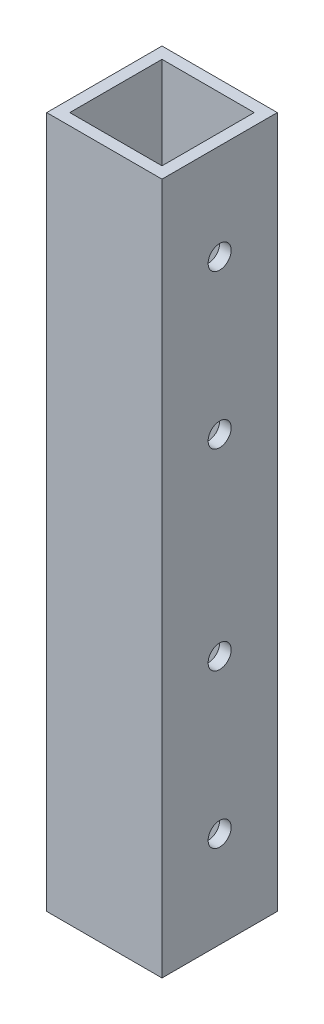
ISO-10303-21;
HEADER;
FILE_DESCRIPTION(('STEP AP214'),'2;1');
FILE_NAME('part.step','',(''),(''),'','','');
FILE_SCHEMA(('AUTOMOTIVE_DESIGN { 1 0 10303 214 1 1 1 1 }'));
ENDSEC;
DATA;
#1=APPLICATION_CONTEXT('core data for automotive mechanical design processes');
#2=APPLICATION_PROTOCOL_DEFINITION('international standard','automotive_design',2000,#1);
#3=PRODUCT_CONTEXT('',#1,'mechanical');
#4=PRODUCT('Part','Part','',(#3));
#5=PRODUCT_RELATED_PRODUCT_CATEGORY('part','',(#4));
#6=PRODUCT_DEFINITION_FORMATION('','',#4);
#7=PRODUCT_DEFINITION_CONTEXT('part definition',#1,'design');
#8=PRODUCT_DEFINITION('design','',#6,#7);
#9=PRODUCT_DEFINITION_SHAPE('','',#8);
#10=(LENGTH_UNIT() NAMED_UNIT(*) SI_UNIT(.MILLI.,.METRE.));
#11=(NAMED_UNIT(*) PLANE_ANGLE_UNIT() SI_UNIT($,.RADIAN.));
#12=(NAMED_UNIT(*) SI_UNIT($,.STERADIAN.) SOLID_ANGLE_UNIT());
#13=UNCERTAINTY_MEASURE_WITH_UNIT(LENGTH_MEASURE(1.E-05),#10,'distance_accuracy_value','');
#14=(GEOMETRIC_REPRESENTATION_CONTEXT(3) GLOBAL_UNCERTAINTY_ASSIGNED_CONTEXT((#13)) GLOBAL_UNIT_ASSIGNED_CONTEXT((#10,
#11,#12)) REPRESENTATION_CONTEXT('',''));
#15=CARTESIAN_POINT('',(0.,0.,0.));
#16=DIRECTION('',(0.,0.,1.));
#17=DIRECTION('',(1.,0.,0.));
#18=AXIS2_PLACEMENT_3D('',#15,#16,#17);
#19=CARTESIAN_POINT('',(0.,90.,0.));
#20=DIRECTION('',(0.,1.,0.));
#21=DIRECTION('',(0.,0.,1.));
#22=AXIS2_PLACEMENT_3D('',#19,#20,#21);
#23=PLANE('',#22);
#24=DIRECTION('',(0.,0.,1.));
#25=VECTOR('',#24,1.);
#26=CARTESIAN_POINT('',(0.,90.,0.));
#27=LINE('',#26,#25);
#28=CARTESIAN_POINT('',(0.,90.,-15.));
#29=VERTEX_POINT('',#28);
#30=CARTESIAN_POINT('',(0.,90.,0.));
#31=VERTEX_POINT('',#30);
#32=EDGE_CURVE('E171',#29,#31,#27,.T.);
#33=ORIENTED_EDGE('',*,*,#32,.T.);
#34=DIRECTION('',(1.,0.,0.));
#35=VECTOR('',#34,1.);
#36=CARTESIAN_POINT('',(0.,90.,0.));
#37=LINE('',#36,#35);
#38=CARTESIAN_POINT('',(15.,90.,0.));
#39=VERTEX_POINT('',#38);
#40=EDGE_CURVE('E174',#31,#39,#37,.T.);
#41=ORIENTED_EDGE('',*,*,#40,.T.);
#42=DIRECTION('',(0.,0.,-1.));
#43=VECTOR('',#42,1.);
#44=CARTESIAN_POINT('',(15.,90.,0.));
#45=LINE('',#44,#43);
#46=CARTESIAN_POINT('',(15.,90.,-15.));
#47=VERTEX_POINT('',#46);
#48=EDGE_CURVE('E177',#39,#47,#45,.T.);
#49=ORIENTED_EDGE('',*,*,#48,.T.);
#50=DIRECTION('',(-1.,0.,0.));
#51=VECTOR('',#50,1.);
#52=CARTESIAN_POINT('',(0.,90.,-15.));
#53=LINE('',#52,#51);
#54=EDGE_CURVE('E179',#47,#29,#53,.T.);
#55=ORIENTED_EDGE('',*,*,#54,.T.);
#56=EDGE_LOOP('',(#33,#41,#49,#55));
#57=FACE_BOUND('',#56,.T.);
#58=DIRECTION('',(1.,0.,0.));
#59=VECTOR('',#58,1.);
#60=CARTESIAN_POINT('',(0.,90.,-1.5));
#61=LINE('',#60,#59);
#62=CARTESIAN_POINT('',(1.5,90.,-1.5));
#63=VERTEX_POINT('',#62);
#64=CARTESIAN_POINT('',(13.5,90.,-1.5));
#65=VERTEX_POINT('',#64);
#66=EDGE_CURVE('E141',#63,#65,#61,.T.);
#67=ORIENTED_EDGE('',*,*,#66,.F.);
#68=DIRECTION('',(0.,0.,1.));
#69=VECTOR('',#68,1.);
#70=CARTESIAN_POINT('',(1.5,90.,0.));
#71=LINE('',#70,#69);
#72=CARTESIAN_POINT('',(1.5,90.,-13.5));
#73=VERTEX_POINT('',#72);
#74=EDGE_CURVE('E133',#73,#63,#71,.T.);
#75=ORIENTED_EDGE('',*,*,#74,.F.);
#76=DIRECTION('',(-1.,0.,0.));
#77=VECTOR('',#76,1.);
#78=CARTESIAN_POINT('',(0.,90.,-13.5));
#79=LINE('',#78,#77);
#80=CARTESIAN_POINT('',(13.5,90.,-13.5));
#81=VERTEX_POINT('',#80);
#82=EDGE_CURVE('E155',#81,#73,#79,.T.);
#83=ORIENTED_EDGE('',*,*,#82,.F.);
#84=DIRECTION('',(0.,0.,-1.));
#85=VECTOR('',#84,1.);
#86=CARTESIAN_POINT('',(13.5,90.,0.));
#87=LINE('',#86,#85);
#88=EDGE_CURVE('E153',#65,#81,#87,.T.);
#89=ORIENTED_EDGE('',*,*,#88,.F.);
#90=EDGE_LOOP('',(#67,#75,#83,#89));
#91=FACE_BOUND('',#90,.T.);
#92=ADVANCED_FACE('F66',(#57,#91),#23,.T.);
#93=CARTESIAN_POINT('',(0.,0.,0.));
#94=DIRECTION('',(0.,1.,0.));
#95=DIRECTION('',(0.,0.,1.));
#96=AXIS2_PLACEMENT_3D('',#93,#94,#95);
#97=PLANE('',#96);
#98=DIRECTION('',(0.,0.,1.));
#99=VECTOR('',#98,1.);
#100=CARTESIAN_POINT('',(0.,0.,0.));
#101=LINE('',#100,#99);
#102=CARTESIAN_POINT('',(0.,0.,-15.));
#103=VERTEX_POINT('',#102);
#104=CARTESIAN_POINT('',(0.,0.,0.));
#105=VERTEX_POINT('',#104);
#106=EDGE_CURVE('E149',#103,#105,#101,.T.);
#107=ORIENTED_EDGE('',*,*,#106,.F.);
#108=DIRECTION('',(-1.,0.,0.));
#109=VECTOR('',#108,1.);
#110=CARTESIAN_POINT('',(0.,0.,-15.));
#111=LINE('',#110,#109);
#112=CARTESIAN_POINT('',(15.,0.,-15.));
#113=VERTEX_POINT('',#112);
#114=EDGE_CURVE('E175',#113,#103,#111,.T.);
#115=ORIENTED_EDGE('',*,*,#114,.F.);
#116=DIRECTION('',(0.,0.,-1.));
#117=VECTOR('',#116,1.);
#118=CARTESIAN_POINT('',(15.,0.,0.));
#119=LINE('',#118,#117);
#120=CARTESIAN_POINT('',(15.,0.,0.));
#121=VERTEX_POINT('',#120);
#122=EDGE_CURVE('E186',#121,#113,#119,.T.);
#123=ORIENTED_EDGE('',*,*,#122,.F.);
#124=DIRECTION('',(1.,0.,0.));
#125=VECTOR('',#124,1.);
#126=CARTESIAN_POINT('',(0.,0.,0.));
#127=LINE('',#126,#125);
#128=EDGE_CURVE('E184',#105,#121,#127,.T.);
#129=ORIENTED_EDGE('',*,*,#128,.F.);
#130=EDGE_LOOP('',(#107,#115,#123,#129));
#131=FACE_BOUND('',#130,.T.);
#132=DIRECTION('',(0.,0.,1.));
#133=VECTOR('',#132,1.);
#134=CARTESIAN_POINT('',(1.5,0.,0.));
#135=LINE('',#134,#133);
#136=CARTESIAN_POINT('',(1.5,0.,-13.5));
#137=VERTEX_POINT('',#136);
#138=CARTESIAN_POINT('',(1.5,0.,-1.5));
#139=VERTEX_POINT('',#138);
#140=EDGE_CURVE('E91',#137,#139,#135,.T.);
#141=ORIENTED_EDGE('',*,*,#140,.T.);
#142=DIRECTION('',(1.,0.,0.));
#143=VECTOR('',#142,1.);
#144=CARTESIAN_POINT('',(0.,0.,-1.5));
#145=LINE('',#144,#143);
#146=CARTESIAN_POINT('',(13.5,0.,-1.5));
#147=VERTEX_POINT('',#146);
#148=EDGE_CURVE('E148',#139,#147,#145,.T.);
#149=ORIENTED_EDGE('',*,*,#148,.T.);
#150=DIRECTION('',(0.,0.,-1.));
#151=VECTOR('',#150,1.);
#152=CARTESIAN_POINT('',(13.5,0.,0.));
#153=LINE('',#152,#151);
#154=CARTESIAN_POINT('',(13.5,0.,-13.5));
#155=VERTEX_POINT('',#154);
#156=EDGE_CURVE('E163',#147,#155,#153,.T.);
#157=ORIENTED_EDGE('',*,*,#156,.T.);
#158=DIRECTION('',(-1.,0.,0.));
#159=VECTOR('',#158,1.);
#160=CARTESIAN_POINT('',(0.,0.,-13.5));
#161=LINE('',#160,#159);
#162=EDGE_CURVE('E142',#155,#137,#161,.T.);
#163=ORIENTED_EDGE('',*,*,#162,.T.);
#164=EDGE_LOOP('',(#141,#149,#157,#163));
#165=FACE_BOUND('',#164,.T.);
#166=ADVANCED_FACE('F238',(#131,#165),#97,.F.);
#167=CARTESIAN_POINT('',(0.,90.,0.));
#168=DIRECTION('',(1.,0.,0.));
#169=DIRECTION('',(0.,0.,-1.));
#170=AXIS2_PLACEMENT_3D('',#167,#168,#169);
#171=PLANE('',#170);
#172=CARTESIAN_POINT('',(0.,12.5,-7.49999999999999));
#173=DIRECTION('',(1.,0.,0.));
#174=DIRECTION('',(0.,0.,-1.));
#175=AXIS2_PLACEMENT_3D('',#172,#173,#174);
#176=CIRCLE('',#175,1.5);
#177=CARTESIAN_POINT('',(0.,12.5,-8.99999999999999));
#178=VERTEX_POINT('',#177);
#179=EDGE_CURVE('E200',#178,#178,#176,.T.);
#180=ORIENTED_EDGE('',*,*,#179,.T.);
#181=EDGE_LOOP('',(#180));
#182=FACE_BOUND('',#181,.T.);
#183=CARTESIAN_POINT('',(0.,32.5,-7.5));
#184=DIRECTION('',(1.,0.,0.));
#185=DIRECTION('',(0.,0.,-1.));
#186=AXIS2_PLACEMENT_3D('',#183,#184,#185);
#187=CIRCLE('',#186,1.5);
#188=CARTESIAN_POINT('',(0.,32.5,-9.));
#189=VERTEX_POINT('',#188);
#190=EDGE_CURVE('E295',#189,#189,#187,.T.);
#191=ORIENTED_EDGE('',*,*,#190,.T.);
#192=EDGE_LOOP('',(#191));
#193=FACE_BOUND('',#192,.T.);
#194=CARTESIAN_POINT('',(0.,57.499999999994,-7.50000000000003));
#195=DIRECTION('',(1.,0.,0.));
#196=DIRECTION('',(0.,0.,-1.));
#197=AXIS2_PLACEMENT_3D('',#194,#195,#196);
#198=CIRCLE('',#197,1.5);
#199=CARTESIAN_POINT('',(0.,57.499999999994,-9.00000000000003));
#200=VERTEX_POINT('',#199);
#201=EDGE_CURVE('E299',#200,#200,#198,.T.);
#202=ORIENTED_EDGE('',*,*,#201,.T.);
#203=EDGE_LOOP('',(#202));
#204=FACE_BOUND('',#203,.T.);
#205=CARTESIAN_POINT('',(0.,77.499999999994,-7.50000000000003));
#206=DIRECTION('',(1.,0.,0.));
#207=DIRECTION('',(0.,0.,-1.));
#208=AXIS2_PLACEMENT_3D('',#205,#206,#207);
#209=CIRCLE('',#208,1.5);
#210=CARTESIAN_POINT('',(0.,77.499999999994,-9.00000000000003));
#211=VERTEX_POINT('',#210);
#212=EDGE_CURVE('E302',#211,#211,#209,.T.);
#213=ORIENTED_EDGE('',*,*,#212,.T.);
#214=EDGE_LOOP('',(#213));
#215=FACE_BOUND('',#214,.T.);
#216=ORIENTED_EDGE('',*,*,#106,.T.);
#217=DIRECTION('',(0.,-1.,0.));
#218=VECTOR('',#217,1.);
#219=CARTESIAN_POINT('',(0.,90.,0.));
#220=LINE('',#219,#218);
#221=EDGE_CURVE('E12',#31,#105,#220,.T.);
#222=ORIENTED_EDGE('',*,*,#221,.F.);
#223=ORIENTED_EDGE('',*,*,#32,.F.);
#224=DIRECTION('',(0.,-1.,0.));
#225=VECTOR('',#224,1.);
#226=CARTESIAN_POINT('',(0.,90.,-15.));
#227=LINE('',#226,#225);
#228=EDGE_CURVE('E181',#29,#103,#227,.T.);
#229=ORIENTED_EDGE('',*,*,#228,.T.);
#230=EDGE_LOOP('',(#216,#222,#223,#229));
#231=FACE_BOUND('',#230,.T.);
#232=ADVANCED_FACE('F68',(#182,#193,#204,#215,#231),#171,.F.);
#233=CARTESIAN_POINT('',(0.,90.,0.));
#234=DIRECTION('',(0.,0.,-1.));
#235=DIRECTION('',(-1.,0.,0.));
#236=AXIS2_PLACEMENT_3D('',#233,#234,#235);
#237=PLANE('',#236);
#238=ORIENTED_EDGE('',*,*,#128,.T.);
#239=DIRECTION('',(0.,-1.,0.));
#240=VECTOR('',#239,1.);
#241=CARTESIAN_POINT('',(15.,90.,0.));
#242=LINE('',#241,#240);
#243=EDGE_CURVE('E75',#39,#121,#242,.T.);
#244=ORIENTED_EDGE('',*,*,#243,.F.);
#245=ORIENTED_EDGE('',*,*,#40,.F.);
#246=ORIENTED_EDGE('',*,*,#221,.T.);
#247=EDGE_LOOP('',(#238,#244,#245,#246));
#248=FACE_BOUND('',#247,.T.);
#249=ADVANCED_FACE('F268',(#248),#237,.F.);
#250=CARTESIAN_POINT('',(15.,90.,0.));
#251=DIRECTION('',(-1.,0.,0.));
#252=DIRECTION('',(0.,0.,1.));
#253=AXIS2_PLACEMENT_3D('',#250,#251,#252);
#254=PLANE('',#253);
#255=CARTESIAN_POINT('',(15.,12.5,-7.49999999999999));
#256=DIRECTION('',(1.,0.,0.));
#257=DIRECTION('',(0.,0.,-1.));
#258=AXIS2_PLACEMENT_3D('',#255,#256,#257);
#259=CIRCLE('',#258,1.5);
#260=CARTESIAN_POINT('',(15.,12.5,-8.99999999999999));
#261=VERTEX_POINT('',#260);
#262=EDGE_CURVE('E316',#261,#261,#259,.T.);
#263=ORIENTED_EDGE('',*,*,#262,.F.);
#264=EDGE_LOOP('',(#263));
#265=FACE_BOUND('',#264,.T.);
#266=CARTESIAN_POINT('',(15.,32.5,-7.5));
#267=DIRECTION('',(1.,0.,0.));
#268=DIRECTION('',(0.,0.,-1.));
#269=AXIS2_PLACEMENT_3D('',#266,#267,#268);
#270=CIRCLE('',#269,1.5);
#271=CARTESIAN_POINT('',(15.,32.5,-9.));
#272=VERTEX_POINT('',#271);
#273=EDGE_CURVE('E313',#272,#272,#270,.T.);
#274=ORIENTED_EDGE('',*,*,#273,.F.);
#275=EDGE_LOOP('',(#274));
#276=FACE_BOUND('',#275,.T.);
#277=CARTESIAN_POINT('',(15.,57.499999999994,-7.50000000000003));
#278=DIRECTION('',(1.,0.,0.));
#279=DIRECTION('',(0.,0.,-1.));
#280=AXIS2_PLACEMENT_3D('',#277,#278,#279);
#281=CIRCLE('',#280,1.5);
#282=CARTESIAN_POINT('',(15.,57.499999999994,-9.00000000000003));
#283=VERTEX_POINT('',#282);
#284=EDGE_CURVE('E309',#283,#283,#281,.T.);
#285=ORIENTED_EDGE('',*,*,#284,.F.);
#286=EDGE_LOOP('',(#285));
#287=FACE_BOUND('',#286,.T.);
#288=CARTESIAN_POINT('',(15.,77.499999999994,-7.50000000000003));
#289=DIRECTION('',(1.,0.,0.));
#290=DIRECTION('',(0.,0.,-1.));
#291=AXIS2_PLACEMENT_3D('',#288,#289,#290);
#292=CIRCLE('',#291,1.5);
#293=CARTESIAN_POINT('',(15.,77.499999999994,-9.00000000000003));
#294=VERTEX_POINT('',#293);
#295=EDGE_CURVE('E304',#294,#294,#292,.T.);
#296=ORIENTED_EDGE('',*,*,#295,.F.);
#297=EDGE_LOOP('',(#296));
#298=FACE_BOUND('',#297,.T.);
#299=ORIENTED_EDGE('',*,*,#122,.T.);
#300=DIRECTION('',(0.,-1.,0.));
#301=VECTOR('',#300,1.);
#302=CARTESIAN_POINT('',(15.,90.,-15.));
#303=LINE('',#302,#301);
#304=EDGE_CURVE('E191',#47,#113,#303,.T.);
#305=ORIENTED_EDGE('',*,*,#304,.F.);
#306=ORIENTED_EDGE('',*,*,#48,.F.);
#307=ORIENTED_EDGE('',*,*,#243,.T.);
#308=EDGE_LOOP('',(#299,#305,#306,#307));
#309=FACE_BOUND('',#308,.T.);
#310=ADVANCED_FACE('F265',(#265,#276,#287,#298,#309),#254,.F.);
#311=CARTESIAN_POINT('',(0.,90.,-15.));
#312=DIRECTION('',(0.,0.,1.));
#313=DIRECTION('',(1.,0.,0.));
#314=AXIS2_PLACEMENT_3D('',#311,#312,#313);
#315=PLANE('',#314);
#316=ORIENTED_EDGE('',*,*,#114,.T.);
#317=ORIENTED_EDGE('',*,*,#228,.F.);
#318=ORIENTED_EDGE('',*,*,#54,.F.);
#319=ORIENTED_EDGE('',*,*,#304,.T.);
#320=EDGE_LOOP('',(#316,#317,#318,#319));
#321=FACE_BOUND('',#320,.T.);
#322=ADVANCED_FACE('F262',(#321),#315,.F.);
#323=CARTESIAN_POINT('',(1.5,90.,0.));
#324=DIRECTION('',(1.,0.,0.));
#325=DIRECTION('',(0.,0.,-1.));
#326=AXIS2_PLACEMENT_3D('',#323,#324,#325);
#327=PLANE('',#326);
#328=CARTESIAN_POINT('',(1.5,12.5,-7.49999999999999));
#329=DIRECTION('',(1.,0.,0.));
#330=DIRECTION('',(0.,0.,-1.));
#331=AXIS2_PLACEMENT_3D('',#328,#329,#330);
#332=CIRCLE('',#331,1.5);
#333=CARTESIAN_POINT('',(1.5,12.5,-8.99999999999999));
#334=VERTEX_POINT('',#333);
#335=EDGE_CURVE('E161',#334,#334,#332,.T.);
#336=ORIENTED_EDGE('',*,*,#335,.F.);
#337=EDGE_LOOP('',(#336));
#338=FACE_BOUND('',#337,.T.);
#339=CARTESIAN_POINT('',(1.5,32.5,-7.5));
#340=DIRECTION('',(1.,0.,0.));
#341=DIRECTION('',(0.,0.,-1.));
#342=AXIS2_PLACEMENT_3D('',#339,#340,#341);
#343=CIRCLE('',#342,1.5);
#344=CARTESIAN_POINT('',(1.5,32.5,-9.));
#345=VERTEX_POINT('',#344);
#346=EDGE_CURVE('E206',#345,#345,#343,.T.);
#347=ORIENTED_EDGE('',*,*,#346,.F.);
#348=EDGE_LOOP('',(#347));
#349=FACE_BOUND('',#348,.T.);
#350=CARTESIAN_POINT('',(1.5,57.499999999994,-7.50000000000003));
#351=DIRECTION('',(1.,0.,0.));
#352=DIRECTION('',(0.,0.,-1.));
#353=AXIS2_PLACEMENT_3D('',#350,#351,#352);
#354=CIRCLE('',#353,1.5);
#355=CARTESIAN_POINT('',(1.5,57.499999999994,-9.00000000000003));
#356=VERTEX_POINT('',#355);
#357=EDGE_CURVE('E203',#356,#356,#354,.T.);
#358=ORIENTED_EDGE('',*,*,#357,.F.);
#359=EDGE_LOOP('',(#358));
#360=FACE_BOUND('',#359,.T.);
#361=CARTESIAN_POINT('',(1.5,77.499999999994,-7.50000000000003));
#362=DIRECTION('',(1.,0.,0.));
#363=DIRECTION('',(0.,0.,-1.));
#364=AXIS2_PLACEMENT_3D('',#361,#362,#363);
#365=CIRCLE('',#364,1.5);
#366=CARTESIAN_POINT('',(1.5,77.499999999994,-9.00000000000003));
#367=VERTEX_POINT('',#366);
#368=EDGE_CURVE('E199',#367,#367,#365,.T.);
#369=ORIENTED_EDGE('',*,*,#368,.F.);
#370=EDGE_LOOP('',(#369));
#371=FACE_BOUND('',#370,.T.);
#372=ORIENTED_EDGE('',*,*,#140,.F.);
#373=DIRECTION('',(0.,-1.,0.));
#374=VECTOR('',#373,1.);
#375=CARTESIAN_POINT('',(1.5,90.,-13.5));
#376=LINE('',#375,#374);
#377=EDGE_CURVE('E137',#73,#137,#376,.T.);
#378=ORIENTED_EDGE('',*,*,#377,.F.);
#379=ORIENTED_EDGE('',*,*,#74,.T.);
#380=DIRECTION('',(0.,-1.,0.));
#381=VECTOR('',#380,1.);
#382=CARTESIAN_POINT('',(1.5,90.,-1.5));
#383=LINE('',#382,#381);
#384=EDGE_CURVE('E136',#63,#139,#383,.T.);
#385=ORIENTED_EDGE('',*,*,#384,.T.);
#386=EDGE_LOOP('',(#372,#378,#379,#385));
#387=FACE_BOUND('',#386,.T.);
#388=ADVANCED_FACE('F135',(#338,#349,#360,#371,#387),#327,.T.);
#389=CARTESIAN_POINT('',(0.,90.,-1.5));
#390=DIRECTION('',(0.,0.,-1.));
#391=DIRECTION('',(-1.,0.,0.));
#392=AXIS2_PLACEMENT_3D('',#389,#390,#391);
#393=PLANE('',#392);
#394=ORIENTED_EDGE('',*,*,#148,.F.);
#395=ORIENTED_EDGE('',*,*,#384,.F.);
#396=ORIENTED_EDGE('',*,*,#66,.T.);
#397=DIRECTION('',(0.,-1.,0.));
#398=VECTOR('',#397,1.);
#399=CARTESIAN_POINT('',(13.5,90.,-1.5));
#400=LINE('',#399,#398);
#401=EDGE_CURVE('E150',#65,#147,#400,.T.);
#402=ORIENTED_EDGE('',*,*,#401,.T.);
#403=EDGE_LOOP('',(#394,#395,#396,#402));
#404=FACE_BOUND('',#403,.T.);
#405=ADVANCED_FACE('F145',(#404),#393,.T.);
#406=CARTESIAN_POINT('',(13.5,90.,0.));
#407=DIRECTION('',(-1.,0.,0.));
#408=DIRECTION('',(0.,0.,1.));
#409=AXIS2_PLACEMENT_3D('',#406,#407,#408);
#410=PLANE('',#409);
#411=CARTESIAN_POINT('',(13.5,12.5,-7.49999999999999));
#412=DIRECTION('',(-1.,0.,0.));
#413=DIRECTION('',(0.,0.,1.));
#414=AXIS2_PLACEMENT_3D('',#411,#412,#413);
#415=CIRCLE('',#414,1.5);
#416=CARTESIAN_POINT('',(13.5,12.5,-5.99999999999999));
#417=VERTEX_POINT('',#416);
#418=EDGE_CURVE('E70',#417,#417,#415,.T.);
#419=ORIENTED_EDGE('',*,*,#418,.F.);
#420=EDGE_LOOP('',(#419));
#421=FACE_BOUND('',#420,.T.);
#422=CARTESIAN_POINT('',(13.5,32.5,-7.5));
#423=DIRECTION('',(-1.,0.,0.));
#424=DIRECTION('',(0.,0.,1.));
#425=AXIS2_PLACEMENT_3D('',#422,#423,#424);
#426=CIRCLE('',#425,1.5);
#427=CARTESIAN_POINT('',(13.5,32.5,-6.));
#428=VERTEX_POINT('',#427);
#429=EDGE_CURVE('E204',#428,#428,#426,.T.);
#430=ORIENTED_EDGE('',*,*,#429,.F.);
#431=EDGE_LOOP('',(#430));
#432=FACE_BOUND('',#431,.T.);
#433=CARTESIAN_POINT('',(13.5,57.499999999994,-7.50000000000003));
#434=DIRECTION('',(-1.,0.,0.));
#435=DIRECTION('',(0.,0.,1.));
#436=AXIS2_PLACEMENT_3D('',#433,#434,#435);
#437=CIRCLE('',#436,1.5);
#438=CARTESIAN_POINT('',(13.5,57.499999999994,-6.00000000000003));
#439=VERTEX_POINT('',#438);
#440=EDGE_CURVE('E201',#439,#439,#437,.T.);
#441=ORIENTED_EDGE('',*,*,#440,.F.);
#442=EDGE_LOOP('',(#441));
#443=FACE_BOUND('',#442,.T.);
#444=CARTESIAN_POINT('',(13.5,77.499999999994,-7.50000000000003));
#445=DIRECTION('',(-1.,0.,0.));
#446=DIRECTION('',(0.,0.,1.));
#447=AXIS2_PLACEMENT_3D('',#444,#445,#446);
#448=CIRCLE('',#447,1.5);
#449=CARTESIAN_POINT('',(13.5,77.499999999994,-6.00000000000003));
#450=VERTEX_POINT('',#449);
#451=EDGE_CURVE('E196',#450,#450,#448,.T.);
#452=ORIENTED_EDGE('',*,*,#451,.F.);
#453=EDGE_LOOP('',(#452));
#454=FACE_BOUND('',#453,.T.);
#455=ORIENTED_EDGE('',*,*,#156,.F.);
#456=ORIENTED_EDGE('',*,*,#401,.F.);
#457=ORIENTED_EDGE('',*,*,#88,.T.);
#458=DIRECTION('',(0.,-1.,0.));
#459=VECTOR('',#458,1.);
#460=CARTESIAN_POINT('',(13.5,90.,-13.5));
#461=LINE('',#460,#459);
#462=EDGE_CURVE('E83',#81,#155,#461,.T.);
#463=ORIENTED_EDGE('',*,*,#462,.T.);
#464=EDGE_LOOP('',(#455,#456,#457,#463));
#465=FACE_BOUND('',#464,.T.);
#466=ADVANCED_FACE('F226',(#421,#432,#443,#454,#465),#410,.T.);
#467=CARTESIAN_POINT('',(0.,90.,-13.5));
#468=DIRECTION('',(0.,0.,1.));
#469=DIRECTION('',(1.,0.,0.));
#470=AXIS2_PLACEMENT_3D('',#467,#468,#469);
#471=PLANE('',#470);
#472=ORIENTED_EDGE('',*,*,#162,.F.);
#473=ORIENTED_EDGE('',*,*,#462,.F.);
#474=ORIENTED_EDGE('',*,*,#82,.T.);
#475=ORIENTED_EDGE('',*,*,#377,.T.);
#476=EDGE_LOOP('',(#472,#473,#474,#475));
#477=FACE_BOUND('',#476,.T.);
#478=ADVANCED_FACE('F229',(#477),#471,.T.);
#479=CARTESIAN_POINT('',(0.,77.499999999994,-7.50000000000003));
#480=DIRECTION('',(1.,0.,0.));
#481=DIRECTION('',(0.,0.,-1.));
#482=AXIS2_PLACEMENT_3D('',#479,#480,#481);
#483=CYLINDRICAL_SURFACE('',#482,1.5);
#484=ORIENTED_EDGE('',*,*,#451,.T.);
#485=EDGE_LOOP('',(#484));
#486=FACE_BOUND('',#485,.T.);
#487=ORIENTED_EDGE('',*,*,#295,.T.);
#488=EDGE_LOOP('',(#487));
#489=FACE_BOUND('',#488,.T.);
#490=ADVANCED_FACE('F240',(#486,#489),#483,.F.);
#491=CARTESIAN_POINT('',(0.,57.499999999994,-7.50000000000003));
#492=DIRECTION('',(1.,0.,0.));
#493=DIRECTION('',(0.,0.,-1.));
#494=AXIS2_PLACEMENT_3D('',#491,#492,#493);
#495=CYLINDRICAL_SURFACE('',#494,1.5);
#496=ORIENTED_EDGE('',*,*,#440,.T.);
#497=EDGE_LOOP('',(#496));
#498=FACE_BOUND('',#497,.T.);
#499=ORIENTED_EDGE('',*,*,#284,.T.);
#500=EDGE_LOOP('',(#499));
#501=FACE_BOUND('',#500,.T.);
#502=ADVANCED_FACE('F247',(#498,#501),#495,.F.);
#503=CARTESIAN_POINT('',(0.,32.5,-7.5));
#504=DIRECTION('',(1.,0.,0.));
#505=DIRECTION('',(0.,0.,-1.));
#506=AXIS2_PLACEMENT_3D('',#503,#504,#505);
#507=CYLINDRICAL_SURFACE('',#506,1.5);
#508=ORIENTED_EDGE('',*,*,#429,.T.);
#509=EDGE_LOOP('',(#508));
#510=FACE_BOUND('',#509,.T.);
#511=ORIENTED_EDGE('',*,*,#273,.T.);
#512=EDGE_LOOP('',(#511));
#513=FACE_BOUND('',#512,.T.);
#514=ADVANCED_FACE('F329',(#510,#513),#507,.F.);
#515=CARTESIAN_POINT('',(0.,12.5,-7.49999999999999));
#516=DIRECTION('',(1.,0.,0.));
#517=DIRECTION('',(0.,0.,-1.));
#518=AXIS2_PLACEMENT_3D('',#515,#516,#517);
#519=CYLINDRICAL_SURFACE('',#518,1.5);
#520=ORIENTED_EDGE('',*,*,#418,.T.);
#521=EDGE_LOOP('',(#520));
#522=FACE_BOUND('',#521,.T.);
#523=ORIENTED_EDGE('',*,*,#262,.T.);
#524=EDGE_LOOP('',(#523));
#525=FACE_BOUND('',#524,.T.);
#526=ADVANCED_FACE('F223',(#522,#525),#519,.F.);
#527=ORIENTED_EDGE('',*,*,#368,.T.);
#528=EDGE_LOOP('',(#527));
#529=FACE_BOUND('',#528,.T.);
#530=ORIENTED_EDGE('',*,*,#212,.F.);
#531=EDGE_LOOP('',(#530));
#532=FACE_BOUND('',#531,.T.);
#533=ADVANCED_FACE('F250',(#529,#532),#483,.F.);
#534=ORIENTED_EDGE('',*,*,#357,.T.);
#535=EDGE_LOOP('',(#534));
#536=FACE_BOUND('',#535,.T.);
#537=ORIENTED_EDGE('',*,*,#201,.F.);
#538=EDGE_LOOP('',(#537));
#539=FACE_BOUND('',#538,.T.);
#540=ADVANCED_FACE('F332',(#536,#539),#495,.F.);
#541=ORIENTED_EDGE('',*,*,#346,.T.);
#542=EDGE_LOOP('',(#541));
#543=FACE_BOUND('',#542,.T.);
#544=ORIENTED_EDGE('',*,*,#190,.F.);
#545=EDGE_LOOP('',(#544));
#546=FACE_BOUND('',#545,.T.);
#547=ADVANCED_FACE('F337',(#543,#546),#507,.F.);
#548=ORIENTED_EDGE('',*,*,#335,.T.);
#549=EDGE_LOOP('',(#548));
#550=FACE_BOUND('',#549,.T.);
#551=ORIENTED_EDGE('',*,*,#179,.F.);
#552=EDGE_LOOP('',(#551));
#553=FACE_BOUND('',#552,.T.);
#554=ADVANCED_FACE('F343',(#550,#553),#519,.F.);
#555=CLOSED_SHELL('',(#92,#166,#232,#249,#310,#322,#388,#405,#466,#478,#490,#502,#514,#526,#533,
#540,#547,#554));
#556=MANIFOLD_SOLID_BREP('B2',#555);
#557=ADVANCED_BREP_SHAPE_REPRESENTATION('',(#18,#556),#14);
#558=SHAPE_DEFINITION_REPRESENTATION(#9,#557);
ENDSEC;
END-ISO-10303-21;
